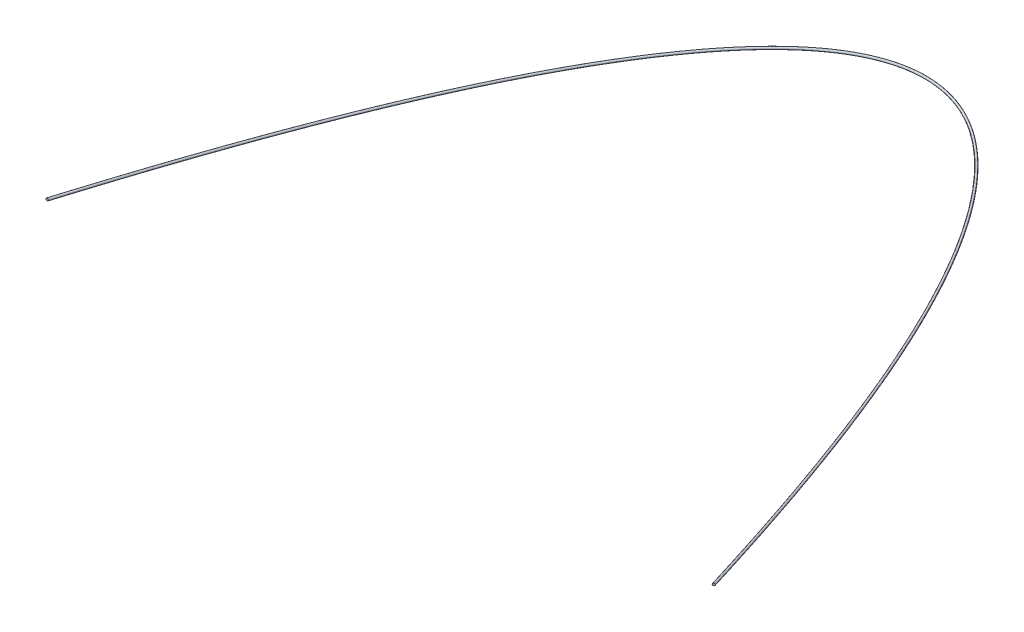
ISO-10303-21;
HEADER;
FILE_DESCRIPTION(('STEP AP214'),'2;1');
FILE_NAME('part.step','',(''),(''),'','','');
FILE_SCHEMA(('AUTOMOTIVE_DESIGN { 1 0 10303 214 1 1 1 1 }'));
ENDSEC;
DATA;
#1=APPLICATION_CONTEXT('core data for automotive mechanical design processes');
#2=APPLICATION_PROTOCOL_DEFINITION('international standard','automotive_design',2000,#1);
#3=PRODUCT_CONTEXT('',#1,'mechanical');
#4=PRODUCT('Part','Part','',(#3));
#5=PRODUCT_RELATED_PRODUCT_CATEGORY('part','',(#4));
#6=PRODUCT_DEFINITION_FORMATION('','',#4);
#7=PRODUCT_DEFINITION_CONTEXT('part definition',#1,'design');
#8=PRODUCT_DEFINITION('design','',#6,#7);
#9=PRODUCT_DEFINITION_SHAPE('','',#8);
#10=(LENGTH_UNIT() NAMED_UNIT(*) SI_UNIT(.MILLI.,.METRE.));
#11=(NAMED_UNIT(*) PLANE_ANGLE_UNIT() SI_UNIT($,.RADIAN.));
#12=(NAMED_UNIT(*) SI_UNIT($,.STERADIAN.) SOLID_ANGLE_UNIT());
#13=UNCERTAINTY_MEASURE_WITH_UNIT(LENGTH_MEASURE(1.E-05),#10,'distance_accuracy_value','');
#14=(GEOMETRIC_REPRESENTATION_CONTEXT(3) GLOBAL_UNCERTAINTY_ASSIGNED_CONTEXT((#13)) GLOBAL_UNIT_ASSIGNED_CONTEXT((#10,
#11,#12)) REPRESENTATION_CONTEXT('',''));
#15=CARTESIAN_POINT('',(0.,0.,0.));
#16=DIRECTION('',(0.,0.,1.));
#17=DIRECTION('',(1.,0.,0.));
#18=AXIS2_PLACEMENT_3D('',#15,#16,#17);
#19=CARTESIAN_POINT('',(0.,0.,0.));
#20=DIRECTION('',(0.,0.,1.));
#21=DIRECTION('',(1.,0.,0.));
#22=AXIS2_PLACEMENT_3D('',#19,#20,#21);
#23=PLANE('',#22);
#24=CARTESIAN_POINT('',(0.,0.,0.));
#25=DIRECTION('',(0.,0.,1.));
#26=DIRECTION('',(1.,0.,0.));
#27=AXIS2_PLACEMENT_3D('',#24,#25,#26);
#28=CIRCLE('',#27,0.45);
#29=CARTESIAN_POINT('',(0.45,0.,0.));
#30=VERTEX_POINT('',#29);
#31=EDGE_CURVE('E36',#30,#30,#28,.T.);
#32=ORIENTED_EDGE('',*,*,#31,.T.);
#33=EDGE_LOOP('',(#32));
#34=FACE_BOUND('',#33,.T.);
#35=ADVANCED_FACE('F33',(#34),#23,.T.);
#36=CARTESIAN_POINT('',(0.45,0.,0.));
#37=CARTESIAN_POINT('',(21.2833333333334,0.,-68.0874029989968));
#38=CARTESIAN_POINT('',(42.1190946711818,0.,-119.142047095704));
#39=CARTESIAN_POINT('',(73.3441026192407,0.,-170.12633976463));
#40=CARTESIAN_POINT('',(83.7483853880753,0.,-182.852505830904));
#41=CARTESIAN_POINT('',(104.500087640719,0.,-199.757352068664));
#42=CARTESIAN_POINT('',(114.832194539387,0.,-203.930685836064));
#43=CARTESIAN_POINT('',(135.431061463759,0.,-203.858966074858));
#44=CARTESIAN_POINT('',(145.730959632385,0.,-199.624049008381));
#45=CARTESIAN_POINT('',(166.428241164629,0.,-182.652616837681));
#46=CARTESIAN_POINT('',(176.809941314102,0.,-169.911966990009));
#47=CARTESIAN_POINT('',(207.984965158901,0.,-118.897095543291));
#48=CARTESIAN_POINT('',(228.805406739889,0.,-67.8392507454048));
#49=CARTESIAN_POINT('',(249.62700413688,0.,0.251742102349595));
#50=CARTESIAN_POINT('',(0.45,0.9,0.));
#51=CARTESIAN_POINT('',(21.2833333333334,0.9,-68.0874029989968));
#52=CARTESIAN_POINT('',(42.1190946711818,0.9,-119.142047095704));
#53=CARTESIAN_POINT('',(73.3441026192407,0.9,-170.12633976463));
#54=CARTESIAN_POINT('',(83.7483853880753,0.9,-182.852505830904));
#55=CARTESIAN_POINT('',(104.500087640719,0.9,-199.757352068664));
#56=CARTESIAN_POINT('',(114.832194539387,0.9,-203.930685836064));
#57=CARTESIAN_POINT('',(135.431061463759,0.9,-203.858966074858));
#58=CARTESIAN_POINT('',(145.730959632385,0.9,-199.624049008381));
#59=CARTESIAN_POINT('',(166.428241164629,0.9,-182.652616837681));
#60=CARTESIAN_POINT('',(176.809941314102,0.9,-169.911966990009));
#61=CARTESIAN_POINT('',(207.984965158901,0.9,-118.897095543291));
#62=CARTESIAN_POINT('',(228.805406739889,0.9,-67.8392507454048));
#63=CARTESIAN_POINT('',(249.62700413688,0.9,0.251742102349595));
#64=CARTESIAN_POINT('',(-0.45,0.9,0.));
#65=CARTESIAN_POINT('',(20.3833333333335,0.9,-68.1293600160523));
#66=CARTESIAN_POINT('',(41.2142386622208,0.9,-119.23728818019));
#67=CARTESIAN_POINT('',(72.4892307140579,0.9,-170.415567773214));
#68=CARTESIAN_POINT('',(82.9182812787781,0.9,-183.23004477277));
#69=CARTESIAN_POINT('',(103.833245692428,0.9,-200.379389287314));
#70=CARTESIAN_POINT('',(114.334472127208,0.9,-204.719603209083));
#71=CARTESIAN_POINT('',(135.402271869647,0.9,-204.79132297029));
#72=CARTESIAN_POINT('',(145.935707034281,0.9,-200.512692348648));
#73=CARTESIAN_POINT('',(166.905092168705,0.9,-183.429933764941));
#74=CARTESIAN_POINT('',(177.356725352565,0.9,-170.629940548514));
#75=CARTESIAN_POINT('',(208.681701507766,0.9,-119.482239731244));
#76=CARTESIAN_POINT('',(229.527926589491,0.9,-68.3775122696509));
#77=CARTESIAN_POINT('',(250.37299586312,0.9,-0.251742102349595));
#78=CARTESIAN_POINT('',(-0.45,0.,0.));
#79=CARTESIAN_POINT('',(20.3833333333335,0.,-68.1293600160523));
#80=CARTESIAN_POINT('',(41.21423866229,0.,-119.23728818019));
#81=CARTESIAN_POINT('',(72.4892307140233,0.,-170.415567773214));
#82=CARTESIAN_POINT('',(82.9182812787781,0.,-183.23004477277));
#83=CARTESIAN_POINT('',(103.833245692428,0.,-200.379389287314));
#84=CARTESIAN_POINT('',(114.334472127208,0.,-204.719603209083));
#85=CARTESIAN_POINT('',(135.402271869647,0.,-204.79132297029));
#86=CARTESIAN_POINT('',(145.935707034281,0.,-200.512692348648));
#87=CARTESIAN_POINT('',(166.905092168705,0.,-183.429933764941));
#88=CARTESIAN_POINT('',(177.356725352565,0.,-170.629940548514));
#89=CARTESIAN_POINT('',(208.681701507766,0.,-119.482239731244));
#90=CARTESIAN_POINT('',(229.527926589491,0.,-68.3775122696518));
#91=CARTESIAN_POINT('',(250.37299586312,0.,-0.251742102349595));
#92=CARTESIAN_POINT('',(-0.45,-0.9,0.));
#93=CARTESIAN_POINT('',(20.3833333333335,-0.9,-68.1293600160523));
#94=CARTESIAN_POINT('',(41.2142386623593,-0.9,-119.23728818019));
#95=CARTESIAN_POINT('',(72.4892307139887,-0.9,-170.415567773214));
#96=CARTESIAN_POINT('',(82.9182812787781,-0.9,-183.23004477277));
#97=CARTESIAN_POINT('',(103.833245692428,-0.9,-200.379389287314));
#98=CARTESIAN_POINT('',(114.334472127208,-0.9,-204.719603209083));
#99=CARTESIAN_POINT('',(135.402271869647,-0.9,-204.79132297029));
#100=CARTESIAN_POINT('',(145.935707034281,-0.9,-200.512692348648));
#101=CARTESIAN_POINT('',(166.905092168705,-0.9,-183.429933764941));
#102=CARTESIAN_POINT('',(177.356725352565,-0.9,-170.629940548514));
#103=CARTESIAN_POINT('',(208.681701507766,-0.9,-119.482239731244));
#104=CARTESIAN_POINT('',(229.527926589491,-0.9,-68.3775122696528));
#105=CARTESIAN_POINT('',(250.37299586312,-0.9,-0.251742102349595));
#106=CARTESIAN_POINT('',(0.45,-0.9,0.));
#107=CARTESIAN_POINT('',(21.2833333333334,-0.9,-68.0874029989968));
#108=CARTESIAN_POINT('',(42.1190946711818,-0.9,-119.142047095704));
#109=CARTESIAN_POINT('',(73.3441026192407,-0.9,-170.12633976463));
#110=CARTESIAN_POINT('',(83.7483853880753,-0.9,-182.852505830904));
#111=CARTESIAN_POINT('',(104.500087640719,-0.9,-199.757352068664));
#112=CARTESIAN_POINT('',(114.832194539387,-0.9,-203.930685836064));
#113=CARTESIAN_POINT('',(135.431061463759,-0.9,-203.858966074858));
#114=CARTESIAN_POINT('',(145.730959632385,-0.9,-199.624049008381));
#115=CARTESIAN_POINT('',(166.428241164629,-0.9,-182.652616837681));
#116=CARTESIAN_POINT('',(176.809941314102,-0.9,-169.911966990009));
#117=CARTESIAN_POINT('',(207.984965158901,-0.9,-118.897095543291));
#118=CARTESIAN_POINT('',(228.805406739889,-0.9,-67.8392507454048));
#119=CARTESIAN_POINT('',(249.62700413688,-0.9,0.251742102349595));
#120=CARTESIAN_POINT('',(0.45,0.,0.));
#121=CARTESIAN_POINT('',(21.2833333333334,0.,-68.0874029989968));
#122=CARTESIAN_POINT('',(42.1190946711818,0.,-119.142047095704));
#123=CARTESIAN_POINT('',(73.3441026192407,0.,-170.12633976463));
#124=CARTESIAN_POINT('',(83.7483853880753,0.,-182.852505830904));
#125=CARTESIAN_POINT('',(104.500087640719,0.,-199.757352068664));
#126=CARTESIAN_POINT('',(114.832194539387,0.,-203.930685836064));
#127=CARTESIAN_POINT('',(135.431061463759,0.,-203.858966074858));
#128=CARTESIAN_POINT('',(145.730959632385,0.,-199.624049008381));
#129=CARTESIAN_POINT('',(166.428241164629,0.,-182.652616837681));
#130=CARTESIAN_POINT('',(176.809941314102,0.,-169.911966990009));
#131=CARTESIAN_POINT('',(207.984965158901,0.,-118.897095543291));
#132=CARTESIAN_POINT('',(228.805406739889,0.,-67.8392507454048));
#133=CARTESIAN_POINT('',(249.62700413688,0.,0.251742102349595));
#134=(BOUNDED_SURFACE() B_SPLINE_SURFACE(3,3,((#36,#37,#38,#39,#40,#41,#42,#43,#44,#45,#46,#47,
#48,#49),(#50,#51,#52,#53,#54,#55,#56,#57,#58,#59,#60,#61,#62,#63),(#64,#65,#66,#67,#68,#69,#70,
#71,#72,#73,#74,#75,#76,#77),(#78,#79,#80,#81,#82,#83,#84,#85,#86,#87,#88,#89,#90,#91),(#92,#93,
#94,#95,#96,#97,#98,#99,#100,#101,#102,#103,#104,#105),(#106,#107,#108,#109,#110,#111,#112,#113,
#114,#115,#116,#117,#118,#119),(#120,#121,#122,#123,#124,#125,#126,#127,#128,#129,#130,#131,
#132,#133)),.UNSPECIFIED.,.T.,.F.,.F.) B_SPLINE_SURFACE_WITH_KNOTS((4,3,4),(4,2,2,2,2,2,4),(0.,
0.5,1.),(0.,0.25,0.375,0.5,0.625,0.75,1.),
.UNSPECIFIED.) GEOMETRIC_REPRESENTATION_ITEM() RATIONAL_B_SPLINE_SURFACE(((1.,1.,1.,1.,1.,1.,1.,
1.,1.,1.,1.,1.,1.,1.),(0.333333333333333,0.333333333333333,0.333333333333333,0.333333333333333,
0.333333333333333,0.333333333333333,0.333333333333333,0.333333333333333,0.333333333333333,
0.333333333333333,0.333333333333333,0.333333333333333,0.333333333333333,0.333333333333333),
(0.333333333333333,0.333333333333333,0.333333333333333,0.333333333333333,0.333333333333333,
0.333333333333333,0.333333333333333,0.333333333333333,0.333333333333333,0.333333333333333,
0.333333333333333,0.333333333333333,0.333333333333333,0.333333333333333),(1.,1.,1.,1.,1.,1.,1.,
1.,1.,1.,1.,1.,1.,1.),(0.333333333333333,0.333333333333333,0.333333333333333,0.333333333333333,
0.333333333333333,0.333333333333333,0.333333333333333,0.333333333333333,0.333333333333333,
0.333333333333333,0.333333333333333,0.333333333333333,0.333333333333333,0.333333333333333),
(0.333333333333333,0.333333333333333,0.333333333333333,0.333333333333333,0.333333333333333,
0.333333333333333,0.333333333333333,0.333333333333333,0.333333333333333,0.333333333333333,
0.333333333333333,0.333333333333333,0.333333333333333,0.333333333333333),(1.,1.,1.,1.,1.,1.,1.,
1.,1.,1.,1.,1.,1.,1.))) REPRESENTATION_ITEM('') SURFACE());
#135=CARTESIAN_POINT('',(250.,0.,0.));
#136=DIRECTION('',(-0.559426894110212,0.,-0.828879695822139));
#137=DIRECTION('',(-0.828879695822139,0.,0.559426894110212));
#138=AXIS2_PLACEMENT_3D('',#135,#136,#137);
#139=CIRCLE('',#138,0.45);
#140=CARTESIAN_POINT('',(249.62700413688,0.,0.251742102349595));
#141=VERTEX_POINT('',#140);
#142=EDGE_CURVE('E11',#141,#141,#139,.T.);
#143=ORIENTED_EDGE('',*,*,#142,.T.);
#144=EDGE_LOOP('',(#143));
#145=FACE_BOUND('',#144,.T.);
#146=ORIENTED_EDGE('',*,*,#31,.F.);
#147=EDGE_LOOP('',(#146));
#148=FACE_BOUND('',#147,.T.);
#149=ADVANCED_FACE('F49',(#145,#148),#134,.F.);
#150=CARTESIAN_POINT('',(250.,0.,0.));
#151=DIRECTION('',(-0.559426894110212,0.,-0.828879695822139));
#152=DIRECTION('',(-0.828879695822139,0.,0.559426894110212));
#153=AXIS2_PLACEMENT_3D('',#150,#151,#152);
#154=PLANE('',#153);
#155=ORIENTED_EDGE('',*,*,#142,.F.);
#156=EDGE_LOOP('',(#155));
#157=FACE_BOUND('',#156,.T.);
#158=ADVANCED_FACE('F47',(#157),#154,.F.);
#159=CLOSED_SHELL('',(#35,#149,#158));
#160=MANIFOLD_SOLID_BREP('B2',#159);
#161=ADVANCED_BREP_SHAPE_REPRESENTATION('',(#18,#160),#14);
#162=SHAPE_DEFINITION_REPRESENTATION(#9,#161);
ENDSEC;
END-ISO-10303-21;
